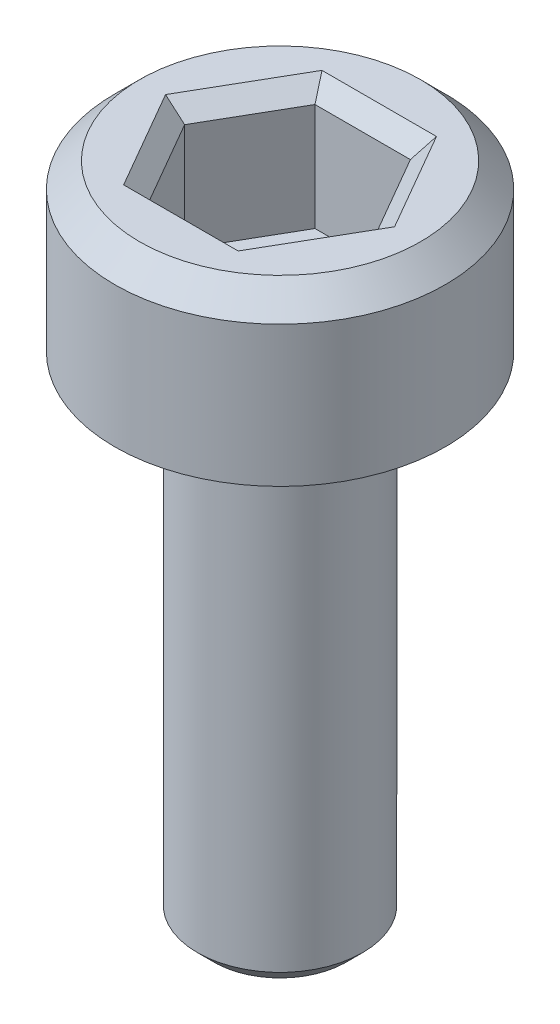
ISO-10303-21;
HEADER;
FILE_DESCRIPTION(('STEP AP214'),'2;1');
FILE_NAME('part.step','',(''),(''),'','','');
FILE_SCHEMA(('AUTOMOTIVE_DESIGN { 1 0 10303 214 1 1 1 1 }'));
ENDSEC;
DATA;
#1=APPLICATION_CONTEXT('core data for automotive mechanical design processes');
#2=APPLICATION_PROTOCOL_DEFINITION('international standard','automotive_design',2000,#1);
#3=PRODUCT_CONTEXT('',#1,'mechanical');
#4=PRODUCT('Part','Part','',(#3));
#5=PRODUCT_RELATED_PRODUCT_CATEGORY('part','',(#4));
#6=PRODUCT_DEFINITION_FORMATION('','',#4);
#7=PRODUCT_DEFINITION_CONTEXT('part definition',#1,'design');
#8=PRODUCT_DEFINITION('design','',#6,#7);
#9=PRODUCT_DEFINITION_SHAPE('','',#8);
#10=(LENGTH_UNIT() NAMED_UNIT(*) SI_UNIT(.MILLI.,.METRE.));
#11=(NAMED_UNIT(*) PLANE_ANGLE_UNIT() SI_UNIT($,.RADIAN.));
#12=(NAMED_UNIT(*) SI_UNIT($,.STERADIAN.) SOLID_ANGLE_UNIT());
#13=UNCERTAINTY_MEASURE_WITH_UNIT(LENGTH_MEASURE(1.E-05),#10,'distance_accuracy_value','');
#14=(GEOMETRIC_REPRESENTATION_CONTEXT(3) GLOBAL_UNCERTAINTY_ASSIGNED_CONTEXT((#13)) GLOBAL_UNIT_ASSIGNED_CONTEXT((#10,
#11,#12)) REPRESENTATION_CONTEXT('',''));
#15=CARTESIAN_POINT('',(0.,0.,0.));
#16=DIRECTION('',(0.,0.,1.));
#17=DIRECTION('',(1.,0.,0.));
#18=AXIS2_PLACEMENT_3D('',#15,#16,#17);
#19=CARTESIAN_POINT('',(0.,0.,0.));
#20=DIRECTION('',(0.,1.,0.));
#21=DIRECTION('',(0.,0.,1.));
#22=AXIS2_PLACEMENT_3D('',#19,#20,#21);
#23=PLANE('',#22);
#24=CARTESIAN_POINT('',(0.,0.,0.));
#25=DIRECTION('',(0.,1.,0.));
#26=DIRECTION('',(0.,0.,1.));
#27=AXIS2_PLACEMENT_3D('',#24,#25,#26);
#28=CIRCLE('',#27,2.);
#29=CARTESIAN_POINT('',(0.,0.,2.));
#30=VERTEX_POINT('',#29);
#31=EDGE_CURVE('E146',#30,#30,#28,.T.);
#32=ORIENTED_EDGE('',*,*,#31,.F.);
#33=EDGE_LOOP('',(#32));
#34=FACE_BOUND('',#33,.T.);
#35=CARTESIAN_POINT('',(0.,0.,0.));
#36=DIRECTION('',(0.,1.,0.));
#37=DIRECTION('',(0.,0.,1.));
#38=AXIS2_PLACEMENT_3D('',#35,#36,#37);
#39=CIRCLE('',#38,1.);
#40=CARTESIAN_POINT('',(0.,0.,1.));
#41=VERTEX_POINT('',#40);
#42=EDGE_CURVE('E185',#41,#41,#39,.F.);
#43=ORIENTED_EDGE('',*,*,#42,.F.);
#44=EDGE_LOOP('',(#43));
#45=FACE_BOUND('',#44,.T.);
#46=ADVANCED_FACE('F33',(#34,#45),#23,.F.);
#47=CARTESIAN_POINT('',(0.,2.,0.));
#48=DIRECTION('',(0.,-1.,0.));
#49=DIRECTION('',(0.,0.,-1.));
#50=AXIS2_PLACEMENT_3D('',#47,#48,#49);
#51=CYLINDRICAL_SURFACE('',#50,2.);
#52=CARTESIAN_POINT('',(0.,1.7,0.));
#53=DIRECTION('',(0.,1.,0.));
#54=DIRECTION('',(0.,0.,1.));
#55=AXIS2_PLACEMENT_3D('',#52,#53,#54);
#56=CIRCLE('',#55,2.);
#57=CARTESIAN_POINT('',(0.,1.7,2.));
#58=VERTEX_POINT('',#57);
#59=EDGE_CURVE('E160',#58,#58,#56,.F.);
#60=ORIENTED_EDGE('',*,*,#59,.T.);
#61=EDGE_LOOP('',(#60));
#62=FACE_BOUND('',#61,.T.);
#63=ORIENTED_EDGE('',*,*,#31,.T.);
#64=EDGE_LOOP('',(#63));
#65=FACE_BOUND('',#64,.T.);
#66=ADVANCED_FACE('F213',(#62,#65),#51,.T.);
#67=CARTESIAN_POINT('',(0.,2.,0.));
#68=DIRECTION('',(0.,1.,0.));
#69=DIRECTION('',(0.,0.,1.));
#70=AXIS2_PLACEMENT_3D('',#67,#68,#69);
#71=PLANE('',#70);
#72=DIRECTION('',(1.,0.,0.));
#73=VECTOR('',#72,1.);
#74=CARTESIAN_POINT('',(0.577350269189625,2.,-1.2));
#75=LINE('',#74,#73);
#76=CARTESIAN_POINT('',(-0.692820323027552,2.,-1.2));
#77=VERTEX_POINT('',#76);
#78=CARTESIAN_POINT('',(0.692820323027551,2.,-1.2));
#79=VERTEX_POINT('',#78);
#80=EDGE_CURVE('E165',#77,#79,#75,.T.);
#81=ORIENTED_EDGE('',*,*,#80,.T.);
#82=DIRECTION('',(0.5,0.,0.866025403784438));
#83=VECTOR('',#82,1.);
#84=CARTESIAN_POINT('',(1.32790561913614,2.,-0.100000000000001));
#85=LINE('',#84,#83);
#86=CARTESIAN_POINT('',(1.3856406460551,2.,0.));
#87=VERTEX_POINT('',#86);
#88=EDGE_CURVE('E175',#79,#87,#85,.T.);
#89=ORIENTED_EDGE('',*,*,#88,.T.);
#90=DIRECTION('',(-0.5,0.,0.866025403784439));
#91=VECTOR('',#90,1.);
#92=CARTESIAN_POINT('',(0.750555349946515,2.,1.1));
#93=LINE('',#92,#91);
#94=CARTESIAN_POINT('',(0.692820323027551,2.,1.2));
#95=VERTEX_POINT('',#94);
#96=EDGE_CURVE('E173',#87,#95,#93,.T.);
#97=ORIENTED_EDGE('',*,*,#96,.T.);
#98=DIRECTION('',(-1.,0.,0.));
#99=VECTOR('',#98,1.);
#100=CARTESIAN_POINT('',(-0.577350269189626,2.,1.2));
#101=LINE('',#100,#99);
#102=CARTESIAN_POINT('',(-0.692820323027551,2.,1.2));
#103=VERTEX_POINT('',#102);
#104=EDGE_CURVE('E171',#95,#103,#101,.T.);
#105=ORIENTED_EDGE('',*,*,#104,.T.);
#106=DIRECTION('',(-0.5,0.,-0.866025403784439));
#107=VECTOR('',#106,1.);
#108=CARTESIAN_POINT('',(-1.32790561913614,2.,0.100000000000001));
#109=LINE('',#108,#107);
#110=CARTESIAN_POINT('',(-1.3856406460551,2.,0.));
#111=VERTEX_POINT('',#110);
#112=EDGE_CURVE('E169',#103,#111,#109,.T.);
#113=ORIENTED_EDGE('',*,*,#112,.T.);
#114=DIRECTION('',(0.5,0.,-0.866025403784439));
#115=VECTOR('',#114,1.);
#116=CARTESIAN_POINT('',(-0.750555349946515,2.,-1.1));
#117=LINE('',#116,#115);
#118=EDGE_CURVE('E167',#111,#77,#117,.T.);
#119=ORIENTED_EDGE('',*,*,#118,.T.);
#120=EDGE_LOOP('',(#81,#89,#97,#105,#113,#119));
#121=FACE_BOUND('',#120,.T.);
#122=CARTESIAN_POINT('',(0.,2.,0.));
#123=DIRECTION('',(0.,1.,0.));
#124=DIRECTION('',(0.,0.,1.));
#125=AXIS2_PLACEMENT_3D('',#122,#123,#124);
#126=CIRCLE('',#125,1.7);
#127=CARTESIAN_POINT('',(0.,2.,1.7));
#128=VERTEX_POINT('',#127);
#129=EDGE_CURVE('E157',#128,#128,#126,.T.);
#130=ORIENTED_EDGE('',*,*,#129,.T.);
#131=EDGE_LOOP('',(#130));
#132=FACE_BOUND('',#131,.T.);
#133=ADVANCED_FACE('F219',(#121,#132),#71,.T.);
#134=CARTESIAN_POINT('',(0.,2.,0.));
#135=DIRECTION('',(0.,-1.,0.));
#136=DIRECTION('',(0.,0.,-1.));
#137=AXIS2_PLACEMENT_3D('',#134,#135,#136);
#138=CONICAL_SURFACE('',#137,1.7,0.785398163397447);
#139=ORIENTED_EDGE('',*,*,#59,.F.);
#140=EDGE_LOOP('',(#139));
#141=FACE_BOUND('',#140,.T.);
#142=ORIENTED_EDGE('',*,*,#129,.F.);
#143=EDGE_LOOP('',(#142));
#144=FACE_BOUND('',#143,.T.);
#145=ADVANCED_FACE('F227',(#141,#144),#138,.T.);
#146=CARTESIAN_POINT('',(0.577350269189626,0.5,1.));
#147=DIRECTION('',(0.866025403784439,0.,0.5));
#148=DIRECTION('',(0.5,0.,-0.866025403784439));
#149=AXIS2_PLACEMENT_3D('',#146,#147,#148);
#150=PLANE('',#149);
#151=DIRECTION('',(0.,1.,0.));
#152=VECTOR('',#151,1.);
#153=CARTESIAN_POINT('',(0.577350269189626,0.5,1.));
#154=LINE('',#153,#152);
#155=CARTESIAN_POINT('',(0.577350269189626,0.5,1.));
#156=VERTEX_POINT('',#155);
#157=CARTESIAN_POINT('',(0.577350269189626,1.8,1.));
#158=VERTEX_POINT('',#157);
#159=EDGE_CURVE('E144',#156,#158,#154,.T.);
#160=ORIENTED_EDGE('',*,*,#159,.T.);
#161=DIRECTION('',(0.5,0.,-0.866025403784439));
#162=VECTOR('',#161,1.);
#163=CARTESIAN_POINT('',(1.15470053837925,1.8,0.));
#164=LINE('',#163,#162);
#165=CARTESIAN_POINT('',(1.15470053837925,1.8,0.));
#166=VERTEX_POINT('',#165);
#167=EDGE_CURVE('E113',#158,#166,#164,.T.);
#168=ORIENTED_EDGE('',*,*,#167,.T.);
#169=DIRECTION('',(0.,1.,0.));
#170=VECTOR('',#169,1.);
#171=CARTESIAN_POINT('',(1.15470053837925,0.5,0.));
#172=LINE('',#171,#170);
#173=CARTESIAN_POINT('',(1.15470053837925,0.5,0.));
#174=VERTEX_POINT('',#173);
#175=EDGE_CURVE('E105',#174,#166,#172,.T.);
#176=ORIENTED_EDGE('',*,*,#175,.F.);
#177=DIRECTION('',(0.5,0.,-0.866025403784439));
#178=VECTOR('',#177,1.);
#179=CARTESIAN_POINT('',(0.577350269189626,0.5,1.));
#180=LINE('',#179,#178);
#181=EDGE_CURVE('E110',#156,#174,#180,.T.);
#182=ORIENTED_EDGE('',*,*,#181,.F.);
#183=EDGE_LOOP('',(#160,#168,#176,#182));
#184=FACE_BOUND('',#183,.T.);
#185=ADVANCED_FACE('F108',(#184),#150,.F.);
#186=CARTESIAN_POINT('',(-0.577350269189626,0.5,1.));
#187=DIRECTION('',(0.,0.,1.));
#188=DIRECTION('',(1.,0.,0.));
#189=AXIS2_PLACEMENT_3D('',#186,#187,#188);
#190=PLANE('',#189);
#191=DIRECTION('',(0.,1.,0.));
#192=VECTOR('',#191,1.);
#193=CARTESIAN_POINT('',(-0.577350269189626,0.5,1.));
#194=LINE('',#193,#192);
#195=CARTESIAN_POINT('',(-0.577350269189626,0.5,1.));
#196=VERTEX_POINT('',#195);
#197=CARTESIAN_POINT('',(-0.577350269189626,1.8,1.));
#198=VERTEX_POINT('',#197);
#199=EDGE_CURVE('E147',#196,#198,#194,.T.);
#200=ORIENTED_EDGE('',*,*,#199,.T.);
#201=DIRECTION('',(1.,0.,0.));
#202=VECTOR('',#201,1.);
#203=CARTESIAN_POINT('',(0.577350269189626,1.8,1.));
#204=LINE('',#203,#202);
#205=EDGE_CURVE('E179',#198,#158,#204,.T.);
#206=ORIENTED_EDGE('',*,*,#205,.T.);
#207=ORIENTED_EDGE('',*,*,#159,.F.);
#208=DIRECTION('',(1.,0.,0.));
#209=VECTOR('',#208,1.);
#210=CARTESIAN_POINT('',(-0.577350269189626,0.5,1.));
#211=LINE('',#210,#209);
#212=EDGE_CURVE('E118',#196,#156,#211,.T.);
#213=ORIENTED_EDGE('',*,*,#212,.F.);
#214=EDGE_LOOP('',(#200,#206,#207,#213));
#215=FACE_BOUND('',#214,.T.);
#216=ADVANCED_FACE('F280',(#215),#190,.F.);
#217=CARTESIAN_POINT('',(-1.15470053837925,0.5,0.));
#218=DIRECTION('',(-0.866025403784438,0.,0.5));
#219=DIRECTION('',(0.5,0.,0.866025403784439));
#220=AXIS2_PLACEMENT_3D('',#217,#218,#219);
#221=PLANE('',#220);
#222=DIRECTION('',(0.,1.,0.));
#223=VECTOR('',#222,1.);
#224=CARTESIAN_POINT('',(-1.15470053837925,0.5,0.));
#225=LINE('',#224,#223);
#226=CARTESIAN_POINT('',(-1.15470053837925,0.5,0.));
#227=VERTEX_POINT('',#226);
#228=CARTESIAN_POINT('',(-1.15470053837925,1.8,0.));
#229=VERTEX_POINT('',#228);
#230=EDGE_CURVE('E150',#227,#229,#225,.T.);
#231=ORIENTED_EDGE('',*,*,#230,.T.);
#232=DIRECTION('',(0.5,0.,0.866025403784439));
#233=VECTOR('',#232,1.);
#234=CARTESIAN_POINT('',(-0.577350269189626,1.8,1.));
#235=LINE('',#234,#233);
#236=EDGE_CURVE('E181',#229,#198,#235,.T.);
#237=ORIENTED_EDGE('',*,*,#236,.T.);
#238=ORIENTED_EDGE('',*,*,#199,.F.);
#239=DIRECTION('',(0.5,0.,0.866025403784439));
#240=VECTOR('',#239,1.);
#241=CARTESIAN_POINT('',(-1.15470053837925,0.5,0.));
#242=LINE('',#241,#240);
#243=EDGE_CURVE('E141',#227,#196,#242,.T.);
#244=ORIENTED_EDGE('',*,*,#243,.F.);
#245=EDGE_LOOP('',(#231,#237,#238,#244));
#246=FACE_BOUND('',#245,.T.);
#247=ADVANCED_FACE('F278',(#246),#221,.F.);
#248=CARTESIAN_POINT('',(-0.577350269189626,0.5,-1.));
#249=DIRECTION('',(-0.866025403784439,0.,-0.5));
#250=DIRECTION('',(-0.5,0.,0.866025403784439));
#251=AXIS2_PLACEMENT_3D('',#248,#249,#250);
#252=PLANE('',#251);
#253=DIRECTION('',(0.,1.,0.));
#254=VECTOR('',#253,1.);
#255=CARTESIAN_POINT('',(-0.577350269189626,0.5,-1.));
#256=LINE('',#255,#254);
#257=CARTESIAN_POINT('',(-0.577350269189626,0.5,-1.));
#258=VERTEX_POINT('',#257);
#259=CARTESIAN_POINT('',(-0.577350269189626,1.8,-1.));
#260=VERTEX_POINT('',#259);
#261=EDGE_CURVE('E152',#258,#260,#256,.T.);
#262=ORIENTED_EDGE('',*,*,#261,.T.);
#263=DIRECTION('',(-0.5,0.,0.866025403784439));
#264=VECTOR('',#263,1.);
#265=CARTESIAN_POINT('',(-1.15470053837925,1.8,0.));
#266=LINE('',#265,#264);
#267=EDGE_CURVE('E55',#260,#229,#266,.T.);
#268=ORIENTED_EDGE('',*,*,#267,.T.);
#269=ORIENTED_EDGE('',*,*,#230,.F.);
#270=DIRECTION('',(-0.5,0.,0.866025403784439));
#271=VECTOR('',#270,1.);
#272=CARTESIAN_POINT('',(-0.577350269189626,0.5,-1.));
#273=LINE('',#272,#271);
#274=EDGE_CURVE('E138',#258,#227,#273,.T.);
#275=ORIENTED_EDGE('',*,*,#274,.F.);
#276=EDGE_LOOP('',(#262,#268,#269,#275));
#277=FACE_BOUND('',#276,.T.);
#278=ADVANCED_FACE('F276',(#277),#252,.F.);
#279=CARTESIAN_POINT('',(0.577350269189625,0.5,-1.));
#280=DIRECTION('',(0.,0.,-1.));
#281=DIRECTION('',(-1.,0.,0.));
#282=AXIS2_PLACEMENT_3D('',#279,#280,#281);
#283=PLANE('',#282);
#284=DIRECTION('',(0.,1.,0.));
#285=VECTOR('',#284,1.);
#286=CARTESIAN_POINT('',(0.577350269189625,0.5,-1.));
#287=LINE('',#286,#285);
#288=CARTESIAN_POINT('',(0.577350269189625,0.5,-1.));
#289=VERTEX_POINT('',#288);
#290=CARTESIAN_POINT('',(0.577350269189625,1.8,-1.));
#291=VERTEX_POINT('',#290);
#292=EDGE_CURVE('E117',#289,#291,#287,.T.);
#293=ORIENTED_EDGE('',*,*,#292,.T.);
#294=DIRECTION('',(-1.,0.,0.));
#295=VECTOR('',#294,1.);
#296=CARTESIAN_POINT('',(-0.577350269189626,1.8,-1.));
#297=LINE('',#296,#295);
#298=EDGE_CURVE('E48',#291,#260,#297,.T.);
#299=ORIENTED_EDGE('',*,*,#298,.T.);
#300=ORIENTED_EDGE('',*,*,#261,.F.);
#301=DIRECTION('',(-1.,0.,0.));
#302=VECTOR('',#301,1.);
#303=CARTESIAN_POINT('',(0.577350269189625,0.5,-1.));
#304=LINE('',#303,#302);
#305=EDGE_CURVE('E126',#289,#258,#304,.T.);
#306=ORIENTED_EDGE('',*,*,#305,.F.);
#307=EDGE_LOOP('',(#293,#299,#300,#306));
#308=FACE_BOUND('',#307,.T.);
#309=ADVANCED_FACE('F273',(#308),#283,.F.);
#310=CARTESIAN_POINT('',(1.15470053837925,0.5,0.));
#311=DIRECTION('',(0.866025403784438,0.,-0.5));
#312=DIRECTION('',(-0.5,0.,-0.866025403784439));
#313=AXIS2_PLACEMENT_3D('',#310,#311,#312);
#314=PLANE('',#313);
#315=ORIENTED_EDGE('',*,*,#175,.T.);
#316=DIRECTION('',(-0.5,0.,-0.866025403784439));
#317=VECTOR('',#316,1.);
#318=CARTESIAN_POINT('',(0.577350269189625,1.8,-1.));
#319=LINE('',#318,#317);
#320=EDGE_CURVE('E163',#166,#291,#319,.T.);
#321=ORIENTED_EDGE('',*,*,#320,.T.);
#322=ORIENTED_EDGE('',*,*,#292,.F.);
#323=DIRECTION('',(-0.5,0.,-0.866025403784438));
#324=VECTOR('',#323,1.);
#325=CARTESIAN_POINT('',(1.15470053837925,0.5,0.));
#326=LINE('',#325,#324);
#327=EDGE_CURVE('E121',#174,#289,#326,.T.);
#328=ORIENTED_EDGE('',*,*,#327,.F.);
#329=EDGE_LOOP('',(#315,#321,#322,#328));
#330=FACE_BOUND('',#329,.T.);
#331=ADVANCED_FACE('F122',(#330),#314,.F.);
#332=CARTESIAN_POINT('',(0.,0.5,0.));
#333=DIRECTION('',(0.,1.,0.));
#334=DIRECTION('',(0.,0.,1.));
#335=AXIS2_PLACEMENT_3D('',#332,#333,#334);
#336=PLANE('',#335);
#337=ORIENTED_EDGE('',*,*,#181,.T.);
#338=ORIENTED_EDGE('',*,*,#327,.T.);
#339=ORIENTED_EDGE('',*,*,#305,.T.);
#340=ORIENTED_EDGE('',*,*,#274,.T.);
#341=ORIENTED_EDGE('',*,*,#243,.T.);
#342=ORIENTED_EDGE('',*,*,#212,.T.);
#343=EDGE_LOOP('',(#337,#338,#339,#340,#341,#342));
#344=FACE_BOUND('',#343,.T.);
#345=ADVANCED_FACE('F128',(#344),#336,.T.);
#346=CARTESIAN_POINT('',(-1.15470053837925,1.8,0.));
#347=DIRECTION('',(0.612372435695792,0.70710678118655,-0.353553390593273));
#348=DIRECTION('',(-0.5,0.,-0.866025403784439));
#349=AXIS2_PLACEMENT_3D('',#346,#347,#348);
#350=PLANE('',#349);
#351=DIRECTION('',(0.755928946018457,-0.654653670707974,0.));
#352=VECTOR('',#351,1.);
#353=CARTESIAN_POINT('',(-1.15470053837925,1.8,0.));
#354=LINE('',#353,#352);
#355=EDGE_CURVE('E134',#111,#229,#354,.T.);
#356=ORIENTED_EDGE('',*,*,#355,.F.);
#357=ORIENTED_EDGE('',*,*,#112,.F.);
#358=DIRECTION('',(0.377964473009227,-0.654653670707974,-0.654653670707981));
#359=VECTOR('',#358,1.);
#360=CARTESIAN_POINT('',(-0.577350269189626,1.8,1.));
#361=LINE('',#360,#359);
#362=EDGE_CURVE('E131',#198,#103,#361,.F.);
#363=ORIENTED_EDGE('',*,*,#362,.F.);
#364=ORIENTED_EDGE('',*,*,#236,.F.);
#365=EDGE_LOOP('',(#356,#357,#363,#364));
#366=FACE_BOUND('',#365,.T.);
#367=ADVANCED_FACE('F249',(#366),#350,.T.);
#368=CARTESIAN_POINT('',(-0.577350269189626,1.8,1.));
#369=DIRECTION('',(0.,0.707106781186551,-0.707106781186544));
#370=DIRECTION('',(-1.,0.,0.));
#371=AXIS2_PLACEMENT_3D('',#368,#369,#370);
#372=PLANE('',#371);
#373=ORIENTED_EDGE('',*,*,#362,.T.);
#374=ORIENTED_EDGE('',*,*,#104,.F.);
#375=DIRECTION('',(-0.377964473009228,-0.654653670707974,-0.654653670707981));
#376=VECTOR('',#375,1.);
#377=CARTESIAN_POINT('',(0.577350269189626,1.8,1.));
#378=LINE('',#377,#376);
#379=EDGE_CURVE('E193',#158,#95,#378,.F.);
#380=ORIENTED_EDGE('',*,*,#379,.F.);
#381=ORIENTED_EDGE('',*,*,#205,.F.);
#382=EDGE_LOOP('',(#373,#374,#380,#381));
#383=FACE_BOUND('',#382,.T.);
#384=ADVANCED_FACE('F246',(#383),#372,.T.);
#385=CARTESIAN_POINT('',(-0.577350269189626,1.8,-1.));
#386=DIRECTION('',(0.612372435695792,0.70710678118655,0.353553390593272));
#387=DIRECTION('',(0.5,0.,-0.866025403784439));
#388=AXIS2_PLACEMENT_3D('',#385,#386,#387);
#389=PLANE('',#388);
#390=ORIENTED_EDGE('',*,*,#355,.T.);
#391=ORIENTED_EDGE('',*,*,#267,.F.);
#392=DIRECTION('',(0.377964473009228,-0.654653670707974,0.65465367070798));
#393=VECTOR('',#392,1.);
#394=CARTESIAN_POINT('',(-0.577350269189626,1.8,-1.));
#395=LINE('',#394,#393);
#396=EDGE_CURVE('E190',#77,#260,#395,.T.);
#397=ORIENTED_EDGE('',*,*,#396,.F.);
#398=ORIENTED_EDGE('',*,*,#118,.F.);
#399=EDGE_LOOP('',(#390,#391,#397,#398));
#400=FACE_BOUND('',#399,.T.);
#401=ADVANCED_FACE('F242',(#400),#389,.T.);
#402=CARTESIAN_POINT('',(0.577350269189626,1.8,1.));
#403=DIRECTION('',(-0.612372435695792,0.70710678118655,-0.353553390593272));
#404=DIRECTION('',(-0.5,0.,0.866025403784439));
#405=AXIS2_PLACEMENT_3D('',#402,#403,#404);
#406=PLANE('',#405);
#407=ORIENTED_EDGE('',*,*,#379,.T.);
#408=ORIENTED_EDGE('',*,*,#96,.F.);
#409=DIRECTION('',(-0.755928946018457,-0.654653670707974,0.));
#410=VECTOR('',#409,1.);
#411=CARTESIAN_POINT('',(1.15470053837925,1.8,0.));
#412=LINE('',#411,#410);
#413=EDGE_CURVE('E188',#166,#87,#412,.F.);
#414=ORIENTED_EDGE('',*,*,#413,.F.);
#415=ORIENTED_EDGE('',*,*,#167,.F.);
#416=EDGE_LOOP('',(#407,#408,#414,#415));
#417=FACE_BOUND('',#416,.T.);
#418=ADVANCED_FACE('F238',(#417),#406,.T.);
#419=CARTESIAN_POINT('',(0.577350269189625,1.8,-1.));
#420=DIRECTION('',(0.,0.707106781186551,0.707106781186544));
#421=DIRECTION('',(1.,0.,0.));
#422=AXIS2_PLACEMENT_3D('',#419,#420,#421);
#423=PLANE('',#422);
#424=ORIENTED_EDGE('',*,*,#396,.T.);
#425=ORIENTED_EDGE('',*,*,#298,.F.);
#426=DIRECTION('',(0.377964473009229,0.654653670707974,-0.65465367070798));
#427=VECTOR('',#426,1.);
#428=CARTESIAN_POINT('',(0.41239304942116,1.51428571428571,-0.714285714285713));
#429=LINE('',#428,#427);
#430=EDGE_CURVE('E186',#79,#291,#429,.F.);
#431=ORIENTED_EDGE('',*,*,#430,.F.);
#432=ORIENTED_EDGE('',*,*,#80,.F.);
#433=EDGE_LOOP('',(#424,#425,#431,#432));
#434=FACE_BOUND('',#433,.T.);
#435=ADVANCED_FACE('F234',(#434),#423,.T.);
#436=CARTESIAN_POINT('',(1.15470053837925,1.8,0.));
#437=DIRECTION('',(-0.612372435695792,0.707106781186551,0.353553390593272));
#438=DIRECTION('',(0.5,0.,0.866025403784439));
#439=AXIS2_PLACEMENT_3D('',#436,#437,#438);
#440=PLANE('',#439);
#441=ORIENTED_EDGE('',*,*,#413,.T.);
#442=ORIENTED_EDGE('',*,*,#88,.F.);
#443=ORIENTED_EDGE('',*,*,#430,.T.);
#444=ORIENTED_EDGE('',*,*,#320,.F.);
#445=EDGE_LOOP('',(#441,#442,#443,#444));
#446=FACE_BOUND('',#445,.T.);
#447=ADVANCED_FACE('F231',(#446),#440,.T.);
#448=CARTESIAN_POINT('',(0.,-6.,0.));
#449=DIRECTION('',(0.,1.,0.));
#450=DIRECTION('',(0.,0.,1.));
#451=AXIS2_PLACEMENT_3D('',#448,#449,#450);
#452=CYLINDRICAL_SURFACE('',#451,1.);
#453=CARTESIAN_POINT('',(0.,-5.8,0.));
#454=DIRECTION('',(0.,-1.,0.));
#455=DIRECTION('',(0.,0.,-1.));
#456=AXIS2_PLACEMENT_3D('',#453,#454,#455);
#457=CIRCLE('',#456,1.);
#458=CARTESIAN_POINT('',(0.,-5.8,-1.));
#459=VERTEX_POINT('',#458);
#460=EDGE_CURVE('E11',#459,#459,#457,.F.);
#461=ORIENTED_EDGE('',*,*,#460,.T.);
#462=EDGE_LOOP('',(#461));
#463=FACE_BOUND('',#462,.T.);
#464=ORIENTED_EDGE('',*,*,#42,.T.);
#465=EDGE_LOOP('',(#464));
#466=FACE_BOUND('',#465,.T.);
#467=ADVANCED_FACE('F209',(#463,#466),#452,.T.);
#468=CARTESIAN_POINT('',(0.,-6.,0.));
#469=DIRECTION('',(0.,-1.,0.));
#470=DIRECTION('',(0.,0.,-1.));
#471=AXIS2_PLACEMENT_3D('',#468,#469,#470);
#472=PLANE('',#471);
#473=CARTESIAN_POINT('',(0.,-6.,0.));
#474=DIRECTION('',(0.,-1.,0.));
#475=DIRECTION('',(0.,0.,-1.));
#476=AXIS2_PLACEMENT_3D('',#473,#474,#475);
#477=CIRCLE('',#476,0.800000000000001);
#478=CARTESIAN_POINT('',(0.,-6.,-0.800000000000001));
#479=VERTEX_POINT('',#478);
#480=EDGE_CURVE('E41',#479,#479,#477,.T.);
#481=ORIENTED_EDGE('',*,*,#480,.T.);
#482=EDGE_LOOP('',(#481));
#483=FACE_BOUND('',#482,.T.);
#484=ADVANCED_FACE('F202',(#483),#472,.T.);
#485=CARTESIAN_POINT('',(0.,-6.,0.));
#486=DIRECTION('',(0.,1.,0.));
#487=DIRECTION('',(0.,0.,1.));
#488=AXIS2_PLACEMENT_3D('',#485,#486,#487);
#489=CONICAL_SURFACE('',#488,0.800000000000001,0.785398163397448);
#490=ORIENTED_EDGE('',*,*,#460,.F.);
#491=EDGE_LOOP('',(#490));
#492=FACE_BOUND('',#491,.T.);
#493=ORIENTED_EDGE('',*,*,#480,.F.);
#494=EDGE_LOOP('',(#493));
#495=FACE_BOUND('',#494,.T.);
#496=ADVANCED_FACE('F35',(#492,#495),#489,.T.);
#497=CLOSED_SHELL('',(#46,#66,#133,#145,#185,#216,#247,#278,#309,#331,#345,#367,#384,#401,#418,
#435,#447,#467,#484,#496));
#498=MANIFOLD_SOLID_BREP('B2',#497);
#499=ADVANCED_BREP_SHAPE_REPRESENTATION('',(#18,#498),#14);
#500=SHAPE_DEFINITION_REPRESENTATION(#9,#499);
ENDSEC;
END-ISO-10303-21;
